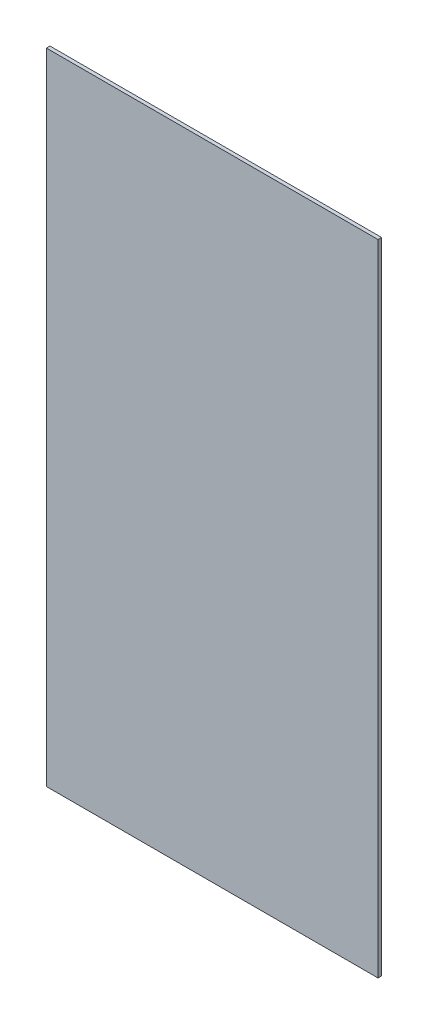
ISO-10303-21;
HEADER;
FILE_DESCRIPTION(('STEP AP214'),'2;1');
FILE_NAME('part.step','',(''),(''),'','','');
FILE_SCHEMA(('AUTOMOTIVE_DESIGN { 1 0 10303 214 1 1 1 1 }'));
ENDSEC;
DATA;
#1=APPLICATION_CONTEXT('core data for automotive mechanical design processes');
#2=APPLICATION_PROTOCOL_DEFINITION('international standard','automotive_design',2000,#1);
#3=PRODUCT_CONTEXT('',#1,'mechanical');
#4=PRODUCT('Part','Part','',(#3));
#5=PRODUCT_RELATED_PRODUCT_CATEGORY('part','',(#4));
#6=PRODUCT_DEFINITION_FORMATION('','',#4);
#7=PRODUCT_DEFINITION_CONTEXT('part definition',#1,'design');
#8=PRODUCT_DEFINITION('design','',#6,#7);
#9=PRODUCT_DEFINITION_SHAPE('','',#8);
#10=(LENGTH_UNIT() NAMED_UNIT(*) SI_UNIT(.MILLI.,.METRE.));
#11=(NAMED_UNIT(*) PLANE_ANGLE_UNIT() SI_UNIT($,.RADIAN.));
#12=(NAMED_UNIT(*) SI_UNIT($,.STERADIAN.) SOLID_ANGLE_UNIT());
#13=UNCERTAINTY_MEASURE_WITH_UNIT(LENGTH_MEASURE(1.E-05),#10,'distance_accuracy_value','');
#14=(GEOMETRIC_REPRESENTATION_CONTEXT(3) GLOBAL_UNCERTAINTY_ASSIGNED_CONTEXT((#13)) GLOBAL_UNIT_ASSIGNED_CONTEXT((#10,
#11,#12)) REPRESENTATION_CONTEXT('',''));
#15=CARTESIAN_POINT('',(0.,0.,0.));
#16=DIRECTION('',(0.,0.,1.));
#17=DIRECTION('',(1.,0.,0.));
#18=AXIS2_PLACEMENT_3D('',#15,#16,#17);
#19=CARTESIAN_POINT('',(-77.4290585614976,86.7005531159428,3.));
#20=DIRECTION('',(1.,0.,0.));
#21=DIRECTION('',(0.,1.,0.));
#22=AXIS2_PLACEMENT_3D('',#19,#20,#21);
#23=PLANE('',#22);
#24=DIRECTION('',(0.,-1.,0.));
#25=VECTOR('',#24,1.);
#26=CARTESIAN_POINT('',(-77.4290585614976,86.7005531159428,0.));
#27=LINE('',#26,#25);
#28=CARTESIAN_POINT('',(-77.4290585614976,86.7005531159428,0.));
#29=VERTEX_POINT('',#28);
#30=CARTESIAN_POINT('',(-77.4290585614975,-453.299446884057,0.));
#31=VERTEX_POINT('',#30);
#32=EDGE_CURVE('E96',#29,#31,#27,.T.);
#33=ORIENTED_EDGE('',*,*,#32,.T.);
#34=DIRECTION('',(0.,0.,-1.));
#35=VECTOR('',#34,1.);
#36=CARTESIAN_POINT('',(-77.4290585614975,-453.299446884057,3.));
#37=LINE('',#36,#35);
#38=CARTESIAN_POINT('',(-77.4290585614975,-453.299446884057,3.));
#39=VERTEX_POINT('',#38);
#40=EDGE_CURVE('E11',#39,#31,#37,.T.);
#41=ORIENTED_EDGE('',*,*,#40,.F.);
#42=DIRECTION('',(0.,-1.,0.));
#43=VECTOR('',#42,1.);
#44=CARTESIAN_POINT('',(-77.4290585614976,86.7005531159428,3.));
#45=LINE('',#44,#43);
#46=CARTESIAN_POINT('',(-77.4290585614976,86.7005531159428,3.));
#47=VERTEX_POINT('',#46);
#48=EDGE_CURVE('E84',#47,#39,#45,.T.);
#49=ORIENTED_EDGE('',*,*,#48,.F.);
#50=DIRECTION('',(0.,0.,-1.));
#51=VECTOR('',#50,1.);
#52=CARTESIAN_POINT('',(-77.4290585614976,86.7005531159428,3.));
#53=LINE('',#52,#51);
#54=EDGE_CURVE('E92',#47,#29,#53,.T.);
#55=ORIENTED_EDGE('',*,*,#54,.T.);
#56=EDGE_LOOP('',(#33,#41,#49,#55));
#57=FACE_BOUND('',#56,.T.);
#58=ADVANCED_FACE('F33',(#57),#23,.F.);
#59=CARTESIAN_POINT('',(-77.4290585614975,-453.299446884057,3.));
#60=DIRECTION('',(0.,1.,0.));
#61=DIRECTION('',(0.,0.,1.));
#62=AXIS2_PLACEMENT_3D('',#59,#60,#61);
#63=PLANE('',#62);
#64=DIRECTION('',(1.,0.,0.));
#65=VECTOR('',#64,1.);
#66=CARTESIAN_POINT('',(-77.4290585614975,-453.299446884057,0.));
#67=LINE('',#66,#65);
#68=CARTESIAN_POINT('',(202.570941438502,-453.299446884057,0.));
#69=VERTEX_POINT('',#68);
#70=EDGE_CURVE('E88',#31,#69,#67,.T.);
#71=ORIENTED_EDGE('',*,*,#70,.T.);
#72=DIRECTION('',(0.,0.,-1.));
#73=VECTOR('',#72,1.);
#74=CARTESIAN_POINT('',(202.570941438502,-453.299446884057,3.));
#75=LINE('',#74,#73);
#76=CARTESIAN_POINT('',(202.570941438502,-453.299446884057,3.));
#77=VERTEX_POINT('',#76);
#78=EDGE_CURVE('E41',#77,#69,#75,.T.);
#79=ORIENTED_EDGE('',*,*,#78,.F.);
#80=DIRECTION('',(1.,0.,0.));
#81=VECTOR('',#80,1.);
#82=CARTESIAN_POINT('',(-77.4290585614975,-453.299446884057,3.));
#83=LINE('',#82,#81);
#84=EDGE_CURVE('E79',#39,#77,#83,.T.);
#85=ORIENTED_EDGE('',*,*,#84,.F.);
#86=ORIENTED_EDGE('',*,*,#40,.T.);
#87=EDGE_LOOP('',(#71,#79,#85,#86));
#88=FACE_BOUND('',#87,.T.);
#89=ADVANCED_FACE('F87',(#88),#63,.F.);
#90=CARTESIAN_POINT('',(202.570941438502,-453.299446884057,3.));
#91=DIRECTION('',(-1.,0.,0.));
#92=DIRECTION('',(0.,0.,1.));
#93=AXIS2_PLACEMENT_3D('',#90,#91,#92);
#94=PLANE('',#93);
#95=DIRECTION('',(0.,1.,0.));
#96=VECTOR('',#95,1.);
#97=CARTESIAN_POINT('',(202.570941438502,-453.299446884057,0.));
#98=LINE('',#97,#96);
#99=CARTESIAN_POINT('',(202.570941438502,86.7005531159428,0.));
#100=VERTEX_POINT('',#99);
#101=EDGE_CURVE('E66',#69,#100,#98,.T.);
#102=ORIENTED_EDGE('',*,*,#101,.T.);
#103=DIRECTION('',(0.,0.,-1.));
#104=VECTOR('',#103,1.);
#105=CARTESIAN_POINT('',(202.570941438502,86.7005531159428,3.));
#106=LINE('',#105,#104);
#107=CARTESIAN_POINT('',(202.570941438502,86.7005531159428,3.));
#108=VERTEX_POINT('',#107);
#109=EDGE_CURVE('E89',#108,#100,#106,.T.);
#110=ORIENTED_EDGE('',*,*,#109,.F.);
#111=DIRECTION('',(0.,1.,0.));
#112=VECTOR('',#111,1.);
#113=CARTESIAN_POINT('',(202.570941438502,-453.299446884057,3.));
#114=LINE('',#113,#112);
#115=EDGE_CURVE('E82',#77,#108,#114,.T.);
#116=ORIENTED_EDGE('',*,*,#115,.F.);
#117=ORIENTED_EDGE('',*,*,#78,.T.);
#118=EDGE_LOOP('',(#102,#110,#116,#117));
#119=FACE_BOUND('',#118,.T.);
#120=ADVANCED_FACE('F90',(#119),#94,.F.);
#121=CARTESIAN_POINT('',(-77.4290585614976,86.7005531159428,3.));
#122=DIRECTION('',(0.,-1.,0.));
#123=DIRECTION('',(0.,0.,-1.));
#124=AXIS2_PLACEMENT_3D('',#121,#122,#123);
#125=PLANE('',#124);
#126=DIRECTION('',(-1.,0.,0.));
#127=VECTOR('',#126,1.);
#128=CARTESIAN_POINT('',(-77.4290585614976,86.7005531159428,0.));
#129=LINE('',#128,#127);
#130=EDGE_CURVE('E72',#100,#29,#129,.T.);
#131=ORIENTED_EDGE('',*,*,#130,.T.);
#132=ORIENTED_EDGE('',*,*,#54,.F.);
#133=DIRECTION('',(-1.,0.,0.));
#134=VECTOR('',#133,1.);
#135=CARTESIAN_POINT('',(-77.4290585614976,86.7005531159428,3.));
#136=LINE('',#135,#134);
#137=EDGE_CURVE('E49',#108,#47,#136,.T.);
#138=ORIENTED_EDGE('',*,*,#137,.F.);
#139=ORIENTED_EDGE('',*,*,#109,.T.);
#140=EDGE_LOOP('',(#131,#132,#138,#139));
#141=FACE_BOUND('',#140,.T.);
#142=ADVANCED_FACE('F103',(#141),#125,.F.);
#143=CARTESIAN_POINT('',(0.,0.,3.));
#144=DIRECTION('',(0.,0.,1.));
#145=DIRECTION('',(1.,0.,0.));
#146=AXIS2_PLACEMENT_3D('',#143,#144,#145);
#147=PLANE('',#146);
#148=ORIENTED_EDGE('',*,*,#48,.T.);
#149=ORIENTED_EDGE('',*,*,#84,.T.);
#150=ORIENTED_EDGE('',*,*,#115,.T.);
#151=ORIENTED_EDGE('',*,*,#137,.T.);
#152=EDGE_LOOP('',(#148,#149,#150,#151));
#153=FACE_BOUND('',#152,.T.);
#154=ADVANCED_FACE('F80',(#153),#147,.T.);
#155=CARTESIAN_POINT('',(0.,0.,0.));
#156=DIRECTION('',(0.,0.,1.));
#157=DIRECTION('',(1.,0.,0.));
#158=AXIS2_PLACEMENT_3D('',#155,#156,#157);
#159=PLANE('',#158);
#160=ORIENTED_EDGE('',*,*,#32,.F.);
#161=ORIENTED_EDGE('',*,*,#130,.F.);
#162=ORIENTED_EDGE('',*,*,#101,.F.);
#163=ORIENTED_EDGE('',*,*,#70,.F.);
#164=EDGE_LOOP('',(#160,#161,#162,#163));
#165=FACE_BOUND('',#164,.T.);
#166=ADVANCED_FACE('F106',(#165),#159,.F.);
#167=CLOSED_SHELL('',(#58,#89,#120,#142,#154,#166));
#168=MANIFOLD_SOLID_BREP('B2',#167);
#169=ADVANCED_BREP_SHAPE_REPRESENTATION('',(#18,#168),#14);
#170=SHAPE_DEFINITION_REPRESENTATION(#9,#169);
ENDSEC;
END-ISO-10303-21;
